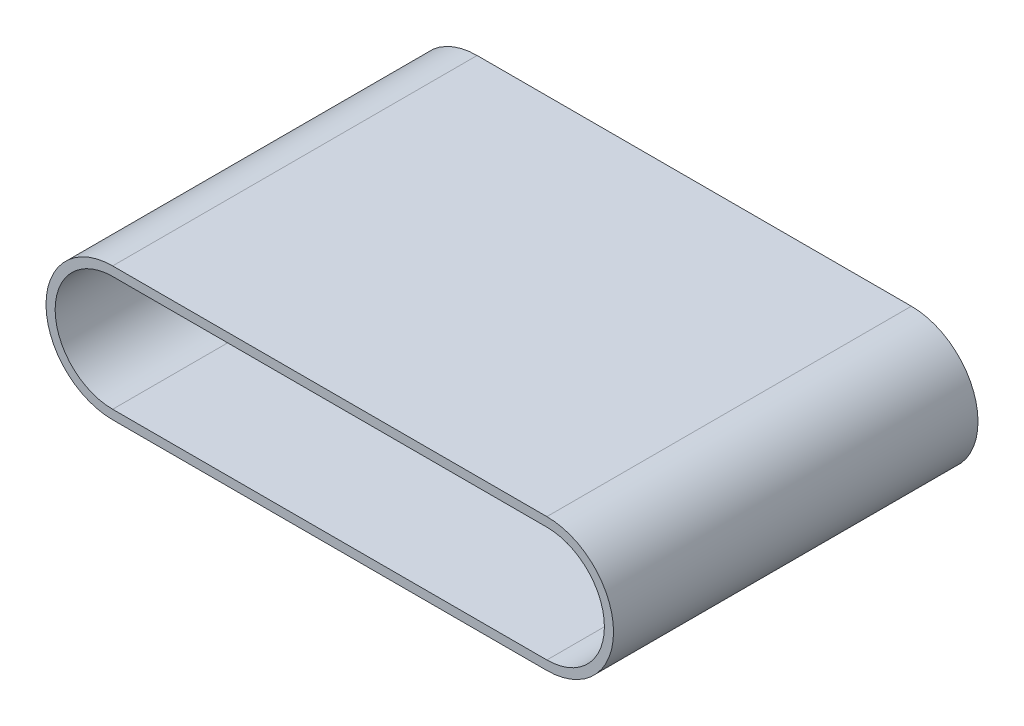
ISO-10303-21;
HEADER;
FILE_DESCRIPTION(('STEP AP214'),'2;1');
FILE_NAME('part.step','',(''),(''),'','','');
FILE_SCHEMA(('AUTOMOTIVE_DESIGN { 1 0 10303 214 1 1 1 1 }'));
ENDSEC;
DATA;
#1=APPLICATION_CONTEXT('core data for automotive mechanical design processes');
#2=APPLICATION_PROTOCOL_DEFINITION('international standard','automotive_design',2000,#1);
#3=PRODUCT_CONTEXT('',#1,'mechanical');
#4=PRODUCT('Part','Part','',(#3));
#5=PRODUCT_RELATED_PRODUCT_CATEGORY('part','',(#4));
#6=PRODUCT_DEFINITION_FORMATION('','',#4);
#7=PRODUCT_DEFINITION_CONTEXT('part definition',#1,'design');
#8=PRODUCT_DEFINITION('design','',#6,#7);
#9=PRODUCT_DEFINITION_SHAPE('','',#8);
#10=(LENGTH_UNIT() NAMED_UNIT(*) SI_UNIT(.MILLI.,.METRE.));
#11=(NAMED_UNIT(*) PLANE_ANGLE_UNIT() SI_UNIT($,.RADIAN.));
#12=(NAMED_UNIT(*) SI_UNIT($,.STERADIAN.) SOLID_ANGLE_UNIT());
#13=UNCERTAINTY_MEASURE_WITH_UNIT(LENGTH_MEASURE(1.E-05),#10,'distance_accuracy_value','');
#14=(GEOMETRIC_REPRESENTATION_CONTEXT(3) GLOBAL_UNCERTAINTY_ASSIGNED_CONTEXT((#13)) GLOBAL_UNIT_ASSIGNED_CONTEXT((#10,
#11,#12)) REPRESENTATION_CONTEXT('',''));
#15=CARTESIAN_POINT('',(0.,0.,0.));
#16=DIRECTION('',(0.,0.,1.));
#17=DIRECTION('',(1.,0.,0.));
#18=AXIS2_PLACEMENT_3D('',#15,#16,#17);
#19=CARTESIAN_POINT('',(0.,0.,5.));
#20=DIRECTION('',(0.,0.,-1.));
#21=DIRECTION('',(-1.,0.,0.));
#22=AXIS2_PLACEMENT_3D('',#19,#20,#21);
#23=CYLINDRICAL_SURFACE('',#22,0.159919521580735);
#24=CARTESIAN_POINT('',(0.,0.,0.));
#25=DIRECTION('',(0.,0.,-1.));
#26=DIRECTION('',(-1.,0.,0.));
#27=AXIS2_PLACEMENT_3D('',#24,#25,#26);
#28=CIRCLE('',#27,0.159919521580735);
#29=CARTESIAN_POINT('',(0.,-0.159919521580735,0.));
#30=VERTEX_POINT('',#29);
#31=CARTESIAN_POINT('',(0.,0.159919521580735,0.));
#32=VERTEX_POINT('',#31);
#33=EDGE_CURVE('E111',#30,#32,#28,.T.);
#34=ORIENTED_EDGE('',*,*,#33,.F.);
#35=DIRECTION('',(0.,0.,-1.));
#36=VECTOR('',#35,1.);
#37=CARTESIAN_POINT('',(0.,-0.159919521580735,5.));
#38=LINE('',#37,#36);
#39=CARTESIAN_POINT('',(0.,-0.159919521580735,5.));
#40=VERTEX_POINT('',#39);
#41=EDGE_CURVE('E12',#40,#30,#38,.T.);
#42=ORIENTED_EDGE('',*,*,#41,.F.);
#43=CARTESIAN_POINT('',(0.,0.,5.));
#44=DIRECTION('',(0.,0.,-1.));
#45=DIRECTION('',(-1.,0.,0.));
#46=AXIS2_PLACEMENT_3D('',#43,#44,#45);
#47=CIRCLE('',#46,0.159919521580735);
#48=CARTESIAN_POINT('',(0.,0.159919521580735,5.));
#49=VERTEX_POINT('',#48);
#50=EDGE_CURVE('E105',#40,#49,#47,.T.);
#51=ORIENTED_EDGE('',*,*,#50,.T.);
#52=DIRECTION('',(0.,0.,-1.));
#53=VECTOR('',#52,1.);
#54=CARTESIAN_POINT('',(0.,0.159919521580735,5.));
#55=LINE('',#54,#53);
#56=EDGE_CURVE('E50',#49,#32,#55,.T.);
#57=ORIENTED_EDGE('',*,*,#56,.T.);
#58=EDGE_LOOP('',(#34,#42,#51,#57));
#59=FACE_BOUND('',#58,.T.);
#60=ADVANCED_FACE('F47',(#59),#23,.T.);
#61=CARTESIAN_POINT('',(0.,-0.159919521580735,5.));
#62=DIRECTION('',(0.,-1.,0.));
#63=DIRECTION('',(0.,0.,-1.));
#64=AXIS2_PLACEMENT_3D('',#61,#62,#63);
#65=PLANE('',#64);
#66=DIRECTION('',(-1.,0.,0.));
#67=VECTOR('',#66,1.);
#68=CARTESIAN_POINT('',(0.,-0.159919521580735,0.));
#69=LINE('',#68,#67);
#70=CARTESIAN_POINT('',(8.35017588066031,-0.159919521580735,0.));
#71=VERTEX_POINT('',#70);
#72=EDGE_CURVE('E107',#71,#30,#69,.T.);
#73=ORIENTED_EDGE('',*,*,#72,.F.);
#74=DIRECTION('',(0.,0.,-1.));
#75=VECTOR('',#74,1.);
#76=CARTESIAN_POINT('',(8.35017588066031,-0.159919521580735,5.));
#77=LINE('',#76,#75);
#78=CARTESIAN_POINT('',(8.35017588066031,-0.159919521580735,5.));
#79=VERTEX_POINT('',#78);
#80=EDGE_CURVE('E56',#79,#71,#77,.T.);
#81=ORIENTED_EDGE('',*,*,#80,.F.);
#82=DIRECTION('',(-1.,0.,0.));
#83=VECTOR('',#82,1.);
#84=CARTESIAN_POINT('',(0.,-0.159919521580735,5.));
#85=LINE('',#84,#83);
#86=EDGE_CURVE('E102',#79,#40,#85,.T.);
#87=ORIENTED_EDGE('',*,*,#86,.T.);
#88=ORIENTED_EDGE('',*,*,#41,.T.);
#89=EDGE_LOOP('',(#73,#81,#87,#88));
#90=FACE_BOUND('',#89,.T.);
#91=ADVANCED_FACE('F121',(#90),#65,.T.);
#92=CARTESIAN_POINT('',(8.35017588066031,0.,5.));
#93=DIRECTION('',(0.,0.,-1.));
#94=DIRECTION('',(-1.,0.,0.));
#95=AXIS2_PLACEMENT_3D('',#92,#93,#94);
#96=CYLINDRICAL_SURFACE('',#95,0.159919521580735);
#97=CARTESIAN_POINT('',(8.35017588066031,0.,0.));
#98=DIRECTION('',(0.,0.,-1.));
#99=DIRECTION('',(-1.,0.,0.));
#100=AXIS2_PLACEMENT_3D('',#97,#98,#99);
#101=CIRCLE('',#100,0.159919521580735);
#102=CARTESIAN_POINT('',(8.35017588066031,0.159919521580735,0.));
#103=VERTEX_POINT('',#102);
#104=EDGE_CURVE('E97',#103,#71,#101,.T.);
#105=ORIENTED_EDGE('',*,*,#104,.F.);
#106=DIRECTION('',(0.,0.,-1.));
#107=VECTOR('',#106,1.);
#108=CARTESIAN_POINT('',(8.35017588066031,0.159919521580735,5.));
#109=LINE('',#108,#107);
#110=CARTESIAN_POINT('',(8.35017588066031,0.159919521580735,5.));
#111=VERTEX_POINT('',#110);
#112=EDGE_CURVE('E92',#111,#103,#109,.T.);
#113=ORIENTED_EDGE('',*,*,#112,.F.);
#114=CARTESIAN_POINT('',(8.35017588066031,0.,5.));
#115=DIRECTION('',(0.,0.,-1.));
#116=DIRECTION('',(-1.,0.,0.));
#117=AXIS2_PLACEMENT_3D('',#114,#115,#116);
#118=CIRCLE('',#117,0.159919521580735);
#119=EDGE_CURVE('E95',#111,#79,#118,.T.);
#120=ORIENTED_EDGE('',*,*,#119,.T.);
#121=ORIENTED_EDGE('',*,*,#80,.T.);
#122=EDGE_LOOP('',(#105,#113,#120,#121));
#123=FACE_BOUND('',#122,.T.);
#124=ADVANCED_FACE('F94',(#123),#96,.T.);
#125=CARTESIAN_POINT('',(0.,0.159919521580735,5.));
#126=DIRECTION('',(0.,1.,0.));
#127=DIRECTION('',(0.,0.,1.));
#128=AXIS2_PLACEMENT_3D('',#125,#126,#127);
#129=PLANE('',#128);
#130=DIRECTION('',(1.,0.,0.));
#131=VECTOR('',#130,1.);
#132=CARTESIAN_POINT('',(0.,0.159919521580735,0.));
#133=LINE('',#132,#131);
#134=EDGE_CURVE('E114',#32,#103,#133,.T.);
#135=ORIENTED_EDGE('',*,*,#134,.F.);
#136=ORIENTED_EDGE('',*,*,#56,.F.);
#137=DIRECTION('',(1.,0.,0.));
#138=VECTOR('',#137,1.);
#139=CARTESIAN_POINT('',(0.,0.159919521580735,5.));
#140=LINE('',#139,#138);
#141=EDGE_CURVE('E101',#49,#111,#140,.T.);
#142=ORIENTED_EDGE('',*,*,#141,.T.);
#143=ORIENTED_EDGE('',*,*,#112,.T.);
#144=EDGE_LOOP('',(#135,#136,#142,#143));
#145=FACE_BOUND('',#144,.T.);
#146=ADVANCED_FACE('F104',(#145),#129,.T.);
#147=CARTESIAN_POINT('',(0.,0.,5.));
#148=DIRECTION('',(0.,0.,-1.));
#149=DIRECTION('',(-1.,0.,0.));
#150=AXIS2_PLACEMENT_3D('',#147,#148,#149);
#151=PLANE('',#150);
#152=ORIENTED_EDGE('',*,*,#50,.F.);
#153=ORIENTED_EDGE('',*,*,#86,.F.);
#154=ORIENTED_EDGE('',*,*,#119,.F.);
#155=ORIENTED_EDGE('',*,*,#141,.F.);
#156=EDGE_LOOP('',(#152,#153,#154,#155));
#157=FACE_BOUND('',#156,.T.);
#158=ADVANCED_FACE('F100',(#157),#151,.F.);
#159=CARTESIAN_POINT('',(0.,0.,0.));
#160=DIRECTION('',(0.,0.,-1.));
#161=DIRECTION('',(-1.,0.,0.));
#162=AXIS2_PLACEMENT_3D('',#159,#160,#161);
#163=PLANE('',#162);
#164=ORIENTED_EDGE('',*,*,#33,.T.);
#165=ORIENTED_EDGE('',*,*,#134,.T.);
#166=ORIENTED_EDGE('',*,*,#104,.T.);
#167=ORIENTED_EDGE('',*,*,#72,.T.);
#168=EDGE_LOOP('',(#164,#165,#166,#167));
#169=FACE_BOUND('',#168,.T.);
#170=ADVANCED_FACE('F120',(#169),#163,.T.);
#171=CLOSED_SHELL('',(#60,#91,#124,#146,#158,#170));
#172=MANIFOLD_SOLID_BREP('B2',#171);
#173=CARTESIAN_POINT('',(0.,0.,7.));
#174=DIRECTION('',(0.,0.,1.));
#175=DIRECTION('',(1.,0.,0.));
#176=AXIS2_PLACEMENT_3D('',#173,#174,#175);
#177=PLANE('',#176);
#178=CARTESIAN_POINT('',(0.,0.,7.));
#179=DIRECTION('',(0.,0.,1.));
#180=DIRECTION('',(1.,0.,0.));
#181=AXIS2_PLACEMENT_3D('',#178,#179,#180);
#182=CIRCLE('',#181,1.28);
#183=CARTESIAN_POINT('',(0.,1.28,7.));
#184=VERTEX_POINT('',#183);
#185=CARTESIAN_POINT('',(0.,-1.28,7.));
#186=VERTEX_POINT('',#185);
#187=EDGE_CURVE('E284',#184,#186,#182,.T.);
#188=ORIENTED_EDGE('',*,*,#187,.T.);
#189=DIRECTION('',(1.,0.,0.));
#190=VECTOR('',#189,1.);
#191=CARTESIAN_POINT('',(0.,-1.28,7.));
#192=LINE('',#191,#190);
#193=CARTESIAN_POINT('',(8.34,-1.28,7.));
#194=VERTEX_POINT('',#193);
#195=EDGE_CURVE('E287',#186,#194,#192,.T.);
#196=ORIENTED_EDGE('',*,*,#195,.T.);
#197=CARTESIAN_POINT('',(8.34,0.,7.));
#198=DIRECTION('',(0.,0.,1.));
#199=DIRECTION('',(1.,0.,0.));
#200=AXIS2_PLACEMENT_3D('',#197,#198,#199);
#201=CIRCLE('',#200,1.28);
#202=CARTESIAN_POINT('',(8.34,1.28,7.));
#203=VERTEX_POINT('',#202);
#204=EDGE_CURVE('E290',#194,#203,#201,.T.);
#205=ORIENTED_EDGE('',*,*,#204,.T.);
#206=DIRECTION('',(-1.,0.,0.));
#207=VECTOR('',#206,1.);
#208=CARTESIAN_POINT('',(0.,1.28,7.));
#209=LINE('',#208,#207);
#210=EDGE_CURVE('E292',#203,#184,#209,.T.);
#211=ORIENTED_EDGE('',*,*,#210,.T.);
#212=EDGE_LOOP('',(#188,#196,#205,#211));
#213=FACE_BOUND('',#212,.T.);
#214=DIRECTION('',(1.,0.,0.));
#215=VECTOR('',#214,1.);
#216=CARTESIAN_POINT('',(0.,-1.10445160048132,7.));
#217=LINE('',#216,#215);
#218=CARTESIAN_POINT('',(0.,-1.10445160048132,7.));
#219=VERTEX_POINT('',#218);
#220=CARTESIAN_POINT('',(8.34,-1.10445160048132,7.));
#221=VERTEX_POINT('',#220);
#222=EDGE_CURVE('E256',#219,#221,#217,.T.);
#223=ORIENTED_EDGE('',*,*,#222,.F.);
#224=CARTESIAN_POINT('',(0.,0.,7.));
#225=DIRECTION('',(0.,0.,1.));
#226=DIRECTION('',(1.,0.,0.));
#227=AXIS2_PLACEMENT_3D('',#224,#225,#226);
#228=CIRCLE('',#227,1.10445160048132);
#229=CARTESIAN_POINT('',(0.,1.10445160048132,7.));
#230=VERTEX_POINT('',#229);
#231=EDGE_CURVE('E248',#230,#219,#228,.T.);
#232=ORIENTED_EDGE('',*,*,#231,.F.);
#233=DIRECTION('',(-1.,0.,0.));
#234=VECTOR('',#233,1.);
#235=CARTESIAN_POINT('',(0.,1.10445160048132,7.));
#236=LINE('',#235,#234);
#237=CARTESIAN_POINT('',(8.34,1.10445160048132,7.));
#238=VERTEX_POINT('',#237);
#239=EDGE_CURVE('E270',#238,#230,#236,.T.);
#240=ORIENTED_EDGE('',*,*,#239,.F.);
#241=CARTESIAN_POINT('',(8.34,0.,7.));
#242=DIRECTION('',(0.,0.,1.));
#243=DIRECTION('',(1.,0.,0.));
#244=AXIS2_PLACEMENT_3D('',#241,#242,#243);
#245=CIRCLE('',#244,1.10445160048132);
#246=EDGE_CURVE('E268',#221,#238,#245,.T.);
#247=ORIENTED_EDGE('',*,*,#246,.F.);
#248=EDGE_LOOP('',(#223,#232,#240,#247));
#249=FACE_BOUND('',#248,.T.);
#250=ADVANCED_FACE('F183',(#213,#249),#177,.T.);
#251=CARTESIAN_POINT('',(0.,0.,0.));
#252=DIRECTION('',(0.,0.,1.));
#253=DIRECTION('',(1.,0.,0.));
#254=AXIS2_PLACEMENT_3D('',#251,#252,#253);
#255=PLANE('',#254);
#256=CARTESIAN_POINT('',(0.,0.,0.));
#257=DIRECTION('',(0.,0.,1.));
#258=DIRECTION('',(1.,0.,0.));
#259=AXIS2_PLACEMENT_3D('',#256,#257,#258);
#260=CIRCLE('',#259,1.28);
#261=CARTESIAN_POINT('',(0.,1.28,0.));
#262=VERTEX_POINT('',#261);
#263=CARTESIAN_POINT('',(0.,-1.28,0.));
#264=VERTEX_POINT('',#263);
#265=EDGE_CURVE('E264',#262,#264,#260,.T.);
#266=ORIENTED_EDGE('',*,*,#265,.F.);
#267=DIRECTION('',(-1.,0.,0.));
#268=VECTOR('',#267,1.);
#269=CARTESIAN_POINT('',(0.,1.28,0.));
#270=LINE('',#269,#268);
#271=CARTESIAN_POINT('',(8.34,1.28,0.));
#272=VERTEX_POINT('',#271);
#273=EDGE_CURVE('E288',#272,#262,#270,.T.);
#274=ORIENTED_EDGE('',*,*,#273,.F.);
#275=CARTESIAN_POINT('',(8.34,0.,0.));
#276=DIRECTION('',(0.,0.,1.));
#277=DIRECTION('',(1.,0.,0.));
#278=AXIS2_PLACEMENT_3D('',#275,#276,#277);
#279=CIRCLE('',#278,1.28);
#280=CARTESIAN_POINT('',(8.34,-1.28,0.));
#281=VERTEX_POINT('',#280);
#282=EDGE_CURVE('E299',#281,#272,#279,.T.);
#283=ORIENTED_EDGE('',*,*,#282,.F.);
#284=DIRECTION('',(1.,0.,0.));
#285=VECTOR('',#284,1.);
#286=CARTESIAN_POINT('',(0.,-1.28,0.));
#287=LINE('',#286,#285);
#288=EDGE_CURVE('E297',#264,#281,#287,.T.);
#289=ORIENTED_EDGE('',*,*,#288,.F.);
#290=EDGE_LOOP('',(#266,#274,#283,#289));
#291=FACE_BOUND('',#290,.T.);
#292=CARTESIAN_POINT('',(0.,0.,0.));
#293=DIRECTION('',(0.,0.,1.));
#294=DIRECTION('',(1.,0.,0.));
#295=AXIS2_PLACEMENT_3D('',#292,#293,#294);
#296=CIRCLE('',#295,1.10445160048132);
#297=CARTESIAN_POINT('',(0.,1.10445160048132,0.));
#298=VERTEX_POINT('',#297);
#299=CARTESIAN_POINT('',(0.,-1.10445160048132,0.));
#300=VERTEX_POINT('',#299);
#301=EDGE_CURVE('E206',#298,#300,#296,.T.);
#302=ORIENTED_EDGE('',*,*,#301,.T.);
#303=DIRECTION('',(1.,0.,0.));
#304=VECTOR('',#303,1.);
#305=CARTESIAN_POINT('',(0.,-1.10445160048132,0.));
#306=LINE('',#305,#304);
#307=CARTESIAN_POINT('',(8.34,-1.10445160048132,0.));
#308=VERTEX_POINT('',#307);
#309=EDGE_CURVE('E263',#300,#308,#306,.T.);
#310=ORIENTED_EDGE('',*,*,#309,.T.);
#311=CARTESIAN_POINT('',(8.34,0.,0.));
#312=DIRECTION('',(0.,0.,1.));
#313=DIRECTION('',(1.,0.,0.));
#314=AXIS2_PLACEMENT_3D('',#311,#312,#313);
#315=CIRCLE('',#314,1.10445160048132);
#316=CARTESIAN_POINT('',(8.34,1.10445160048132,0.));
#317=VERTEX_POINT('',#316);
#318=EDGE_CURVE('E276',#308,#317,#315,.T.);
#319=ORIENTED_EDGE('',*,*,#318,.T.);
#320=DIRECTION('',(-1.,0.,0.));
#321=VECTOR('',#320,1.);
#322=CARTESIAN_POINT('',(0.,1.10445160048132,0.));
#323=LINE('',#322,#321);
#324=EDGE_CURVE('E257',#317,#298,#323,.T.);
#325=ORIENTED_EDGE('',*,*,#324,.T.);
#326=EDGE_LOOP('',(#302,#310,#319,#325));
#327=FACE_BOUND('',#326,.T.);
#328=ADVANCED_FACE('F317',(#291,#327),#255,.F.);
#329=CARTESIAN_POINT('',(0.,0.,7.));
#330=DIRECTION('',(0.,0.,-1.));
#331=DIRECTION('',(-1.,0.,0.));
#332=AXIS2_PLACEMENT_3D('',#329,#330,#331);
#333=CYLINDRICAL_SURFACE('',#332,1.28);
#334=ORIENTED_EDGE('',*,*,#265,.T.);
#335=DIRECTION('',(0.,0.,-1.));
#336=VECTOR('',#335,1.);
#337=CARTESIAN_POINT('',(0.,-1.28,7.));
#338=LINE('',#337,#336);
#339=EDGE_CURVE('E45',#186,#264,#338,.T.);
#340=ORIENTED_EDGE('',*,*,#339,.F.);
#341=ORIENTED_EDGE('',*,*,#187,.F.);
#342=DIRECTION('',(0.,0.,-1.));
#343=VECTOR('',#342,1.);
#344=CARTESIAN_POINT('',(0.,1.28,7.));
#345=LINE('',#344,#343);
#346=EDGE_CURVE('E294',#184,#262,#345,.T.);
#347=ORIENTED_EDGE('',*,*,#346,.T.);
#348=EDGE_LOOP('',(#334,#340,#341,#347));
#349=FACE_BOUND('',#348,.T.);
#350=ADVANCED_FACE('F185',(#349),#333,.T.);
#351=CARTESIAN_POINT('',(0.,-1.28,7.));
#352=DIRECTION('',(0.,1.,0.));
#353=DIRECTION('',(0.,0.,1.));
#354=AXIS2_PLACEMENT_3D('',#351,#352,#353);
#355=PLANE('',#354);
#356=ORIENTED_EDGE('',*,*,#288,.T.);
#357=DIRECTION('',(0.,0.,-1.));
#358=VECTOR('',#357,1.);
#359=CARTESIAN_POINT('',(8.34,-1.28,7.));
#360=LINE('',#359,#358);
#361=EDGE_CURVE('E191',#194,#281,#360,.T.);
#362=ORIENTED_EDGE('',*,*,#361,.F.);
#363=ORIENTED_EDGE('',*,*,#195,.F.);
#364=ORIENTED_EDGE('',*,*,#339,.T.);
#365=EDGE_LOOP('',(#356,#362,#363,#364));
#366=FACE_BOUND('',#365,.T.);
#367=ADVANCED_FACE('F327',(#366),#355,.F.);
#368=CARTESIAN_POINT('',(8.34,0.,7.));
#369=DIRECTION('',(0.,0.,-1.));
#370=DIRECTION('',(-1.,0.,0.));
#371=AXIS2_PLACEMENT_3D('',#368,#369,#370);
#372=CYLINDRICAL_SURFACE('',#371,1.28);
#373=ORIENTED_EDGE('',*,*,#282,.T.);
#374=DIRECTION('',(0.,0.,-1.));
#375=VECTOR('',#374,1.);
#376=CARTESIAN_POINT('',(8.34,1.28,7.));
#377=LINE('',#376,#375);
#378=EDGE_CURVE('E304',#203,#272,#377,.T.);
#379=ORIENTED_EDGE('',*,*,#378,.F.);
#380=ORIENTED_EDGE('',*,*,#204,.F.);
#381=ORIENTED_EDGE('',*,*,#361,.T.);
#382=EDGE_LOOP('',(#373,#379,#380,#381));
#383=FACE_BOUND('',#382,.T.);
#384=ADVANCED_FACE('F311',(#383),#372,.T.);
#385=CARTESIAN_POINT('',(0.,1.28,7.));
#386=DIRECTION('',(0.,-1.,0.));
#387=DIRECTION('',(0.,0.,-1.));
#388=AXIS2_PLACEMENT_3D('',#385,#386,#387);
#389=PLANE('',#388);
#390=ORIENTED_EDGE('',*,*,#273,.T.);
#391=ORIENTED_EDGE('',*,*,#346,.F.);
#392=ORIENTED_EDGE('',*,*,#210,.F.);
#393=ORIENTED_EDGE('',*,*,#378,.T.);
#394=EDGE_LOOP('',(#390,#391,#392,#393));
#395=FACE_BOUND('',#394,.T.);
#396=ADVANCED_FACE('F321',(#395),#389,.F.);
#397=CARTESIAN_POINT('',(0.,0.,7.));
#398=DIRECTION('',(0.,0.,-1.));
#399=DIRECTION('',(-1.,0.,0.));
#400=AXIS2_PLACEMENT_3D('',#397,#398,#399);
#401=CYLINDRICAL_SURFACE('',#400,1.10445160048132);
#402=ORIENTED_EDGE('',*,*,#301,.F.);
#403=DIRECTION('',(0.,0.,-1.));
#404=VECTOR('',#403,1.);
#405=CARTESIAN_POINT('',(0.,1.10445160048132,7.));
#406=LINE('',#405,#404);
#407=EDGE_CURVE('E252',#230,#298,#406,.T.);
#408=ORIENTED_EDGE('',*,*,#407,.F.);
#409=ORIENTED_EDGE('',*,*,#231,.T.);
#410=DIRECTION('',(0.,0.,-1.));
#411=VECTOR('',#410,1.);
#412=CARTESIAN_POINT('',(0.,-1.10445160048132,7.));
#413=LINE('',#412,#411);
#414=EDGE_CURVE('E251',#219,#300,#413,.T.);
#415=ORIENTED_EDGE('',*,*,#414,.T.);
#416=EDGE_LOOP('',(#402,#408,#409,#415));
#417=FACE_BOUND('',#416,.T.);
#418=ADVANCED_FACE('F250',(#417),#401,.F.);
#419=CARTESIAN_POINT('',(0.,-1.10445160048132,7.));
#420=DIRECTION('',(0.,1.,0.));
#421=DIRECTION('',(0.,0.,1.));
#422=AXIS2_PLACEMENT_3D('',#419,#420,#421);
#423=PLANE('',#422);
#424=ORIENTED_EDGE('',*,*,#309,.F.);
#425=ORIENTED_EDGE('',*,*,#414,.F.);
#426=ORIENTED_EDGE('',*,*,#222,.T.);
#427=DIRECTION('',(0.,0.,-1.));
#428=VECTOR('',#427,1.);
#429=CARTESIAN_POINT('',(8.34,-1.10445160048132,7.));
#430=LINE('',#429,#428);
#431=EDGE_CURVE('E265',#221,#308,#430,.T.);
#432=ORIENTED_EDGE('',*,*,#431,.T.);
#433=EDGE_LOOP('',(#424,#425,#426,#432));
#434=FACE_BOUND('',#433,.T.);
#435=ADVANCED_FACE('F260',(#434),#423,.T.);
#436=CARTESIAN_POINT('',(8.34,0.,7.));
#437=DIRECTION('',(0.,0.,-1.));
#438=DIRECTION('',(-1.,0.,0.));
#439=AXIS2_PLACEMENT_3D('',#436,#437,#438);
#440=CYLINDRICAL_SURFACE('',#439,1.10445160048132);
#441=ORIENTED_EDGE('',*,*,#318,.F.);
#442=ORIENTED_EDGE('',*,*,#431,.F.);
#443=ORIENTED_EDGE('',*,*,#246,.T.);
#444=DIRECTION('',(0.,0.,-1.));
#445=VECTOR('',#444,1.);
#446=CARTESIAN_POINT('',(8.34,1.10445160048132,7.));
#447=LINE('',#446,#445);
#448=EDGE_CURVE('E198',#238,#317,#447,.T.);
#449=ORIENTED_EDGE('',*,*,#448,.T.);
#450=EDGE_LOOP('',(#441,#442,#443,#449));
#451=FACE_BOUND('',#450,.T.);
#452=ADVANCED_FACE('F350',(#451),#440,.F.);
#453=CARTESIAN_POINT('',(0.,1.10445160048132,7.));
#454=DIRECTION('',(0.,-1.,0.));
#455=DIRECTION('',(0.,0.,-1.));
#456=AXIS2_PLACEMENT_3D('',#453,#454,#455);
#457=PLANE('',#456);
#458=ORIENTED_EDGE('',*,*,#324,.F.);
#459=ORIENTED_EDGE('',*,*,#448,.F.);
#460=ORIENTED_EDGE('',*,*,#239,.T.);
#461=ORIENTED_EDGE('',*,*,#407,.T.);
#462=EDGE_LOOP('',(#458,#459,#460,#461));
#463=FACE_BOUND('',#462,.T.);
#464=ADVANCED_FACE('F354',(#463),#457,.T.);
#465=CLOSED_SHELL('',(#250,#328,#350,#367,#384,#396,#418,#435,#452,#464));
#466=MANIFOLD_SOLID_BREP('B6',#465);
#467=ADVANCED_BREP_SHAPE_REPRESENTATION('',(#18,#172,#466),#14);
#468=SHAPE_DEFINITION_REPRESENTATION(#9,#467);
ENDSEC;
END-ISO-10303-21;
